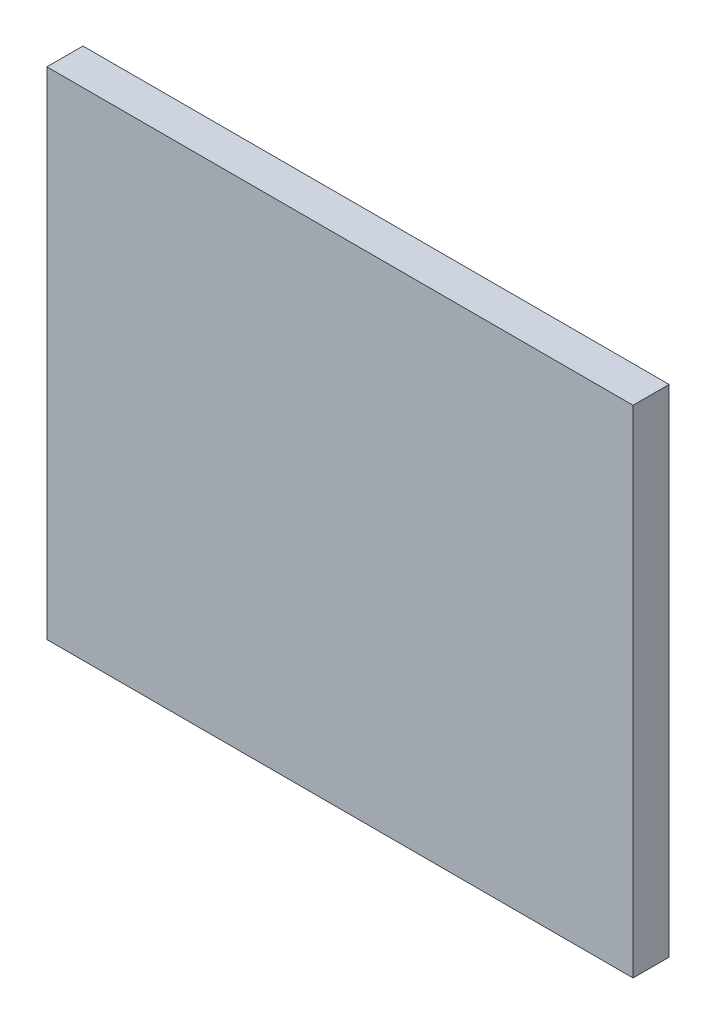
ISO-10303-21;
HEADER;
FILE_DESCRIPTION(('STEP AP214'),'2;1');
FILE_NAME('part.step','',(''),(''),'','','');
FILE_SCHEMA(('AUTOMOTIVE_DESIGN { 1 0 10303 214 1 1 1 1 }'));
ENDSEC;
DATA;
#1=APPLICATION_CONTEXT('core data for automotive mechanical design processes');
#2=APPLICATION_PROTOCOL_DEFINITION('international standard','automotive_design',2000,#1);
#3=PRODUCT_CONTEXT('',#1,'mechanical');
#4=PRODUCT('Part','Part','',(#3));
#5=PRODUCT_RELATED_PRODUCT_CATEGORY('part','',(#4));
#6=PRODUCT_DEFINITION_FORMATION('','',#4);
#7=PRODUCT_DEFINITION_CONTEXT('part definition',#1,'design');
#8=PRODUCT_DEFINITION('design','',#6,#7);
#9=PRODUCT_DEFINITION_SHAPE('','',#8);
#10=(LENGTH_UNIT() NAMED_UNIT(*) SI_UNIT(.MILLI.,.METRE.));
#11=(NAMED_UNIT(*) PLANE_ANGLE_UNIT() SI_UNIT($,.RADIAN.));
#12=(NAMED_UNIT(*) SI_UNIT($,.STERADIAN.) SOLID_ANGLE_UNIT());
#13=UNCERTAINTY_MEASURE_WITH_UNIT(LENGTH_MEASURE(1.E-05),#10,'distance_accuracy_value','');
#14=(GEOMETRIC_REPRESENTATION_CONTEXT(3) GLOBAL_UNCERTAINTY_ASSIGNED_CONTEXT((#13)) GLOBAL_UNIT_ASSIGNED_CONTEXT((#10,
#11,#12)) REPRESENTATION_CONTEXT('',''));
#15=CARTESIAN_POINT('',(0.,0.,0.));
#16=DIRECTION('',(0.,0.,1.));
#17=DIRECTION('',(1.,0.,0.));
#18=AXIS2_PLACEMENT_3D('',#15,#16,#17);
#19=CARTESIAN_POINT('',(0.,0.,0.));
#20=DIRECTION('',(1.,0.,0.));
#21=DIRECTION('',(0.,0.,1.));
#22=AXIS2_PLACEMENT_3D('',#19,#20,#21);
#23=PLANE('',#22);
#24=DIRECTION('',(0.,1.,0.));
#25=VECTOR('',#24,1.);
#26=CARTESIAN_POINT('',(0.,0.,0.04));
#27=LINE('',#26,#25);
#28=CARTESIAN_POINT('',(0.,0.,0.04));
#29=VERTEX_POINT('',#28);
#30=CARTESIAN_POINT('',(0.,0.55,0.04));
#31=VERTEX_POINT('',#30);
#32=EDGE_CURVE('E11',#29,#31,#27,.T.);
#33=ORIENTED_EDGE('',*,*,#32,.T.);
#34=DIRECTION('',(0.,0.,1.));
#35=VECTOR('',#34,1.);
#36=CARTESIAN_POINT('',(0.,0.55,0.));
#37=LINE('',#36,#35);
#38=CARTESIAN_POINT('',(0.,0.55,0.));
#39=VERTEX_POINT('',#38);
#40=EDGE_CURVE('E24',#39,#31,#37,.T.);
#41=ORIENTED_EDGE('',*,*,#40,.F.);
#42=DIRECTION('',(0.,1.,0.));
#43=VECTOR('',#42,1.);
#44=CARTESIAN_POINT('',(0.,0.,0.));
#45=LINE('',#44,#43);
#46=CARTESIAN_POINT('',(0.,0.,0.));
#47=VERTEX_POINT('',#46);
#48=EDGE_CURVE('E86',#47,#39,#45,.T.);
#49=ORIENTED_EDGE('',*,*,#48,.F.);
#50=DIRECTION('',(0.,0.,1.));
#51=VECTOR('',#50,1.);
#52=CARTESIAN_POINT('',(0.,0.,0.));
#53=LINE('',#52,#51);
#54=EDGE_CURVE('E36',#47,#29,#53,.T.);
#55=ORIENTED_EDGE('',*,*,#54,.T.);
#56=EDGE_LOOP('',(#33,#41,#49,#55));
#57=FACE_BOUND('',#56,.T.);
#58=ADVANCED_FACE('F17',(#57),#23,.F.);
#59=CARTESIAN_POINT('',(0.65,0.,0.));
#60=DIRECTION('',(1.,0.,0.));
#61=DIRECTION('',(0.,0.,1.));
#62=AXIS2_PLACEMENT_3D('',#59,#60,#61);
#63=PLANE('',#62);
#64=DIRECTION('',(0.,0.,1.));
#65=VECTOR('',#64,1.);
#66=CARTESIAN_POINT('',(0.65,0.,0.));
#67=LINE('',#66,#65);
#68=CARTESIAN_POINT('',(0.65,0.,0.));
#69=VERTEX_POINT('',#68);
#70=CARTESIAN_POINT('',(0.65,0.,0.04));
#71=VERTEX_POINT('',#70);
#72=EDGE_CURVE('E83',#69,#71,#67,.T.);
#73=ORIENTED_EDGE('',*,*,#72,.F.);
#74=DIRECTION('',(0.,1.,0.));
#75=VECTOR('',#74,1.);
#76=CARTESIAN_POINT('',(0.65,0.,0.));
#77=LINE('',#76,#75);
#78=CARTESIAN_POINT('',(0.65,0.55,0.));
#79=VERTEX_POINT('',#78);
#80=EDGE_CURVE('E63',#69,#79,#77,.T.);
#81=ORIENTED_EDGE('',*,*,#80,.T.);
#82=DIRECTION('',(0.,0.,1.));
#83=VECTOR('',#82,1.);
#84=CARTESIAN_POINT('',(0.65,0.55,0.));
#85=LINE('',#84,#83);
#86=CARTESIAN_POINT('',(0.65,0.55,0.04));
#87=VERTEX_POINT('',#86);
#88=EDGE_CURVE('E57',#79,#87,#85,.T.);
#89=ORIENTED_EDGE('',*,*,#88,.T.);
#90=DIRECTION('',(0.,1.,0.));
#91=VECTOR('',#90,1.);
#92=CARTESIAN_POINT('',(0.65,0.,0.04));
#93=LINE('',#92,#91);
#94=EDGE_CURVE('E60',#71,#87,#93,.T.);
#95=ORIENTED_EDGE('',*,*,#94,.F.);
#96=EDGE_LOOP('',(#73,#81,#89,#95));
#97=FACE_BOUND('',#96,.T.);
#98=ADVANCED_FACE('F59',(#97),#63,.T.);
#99=CARTESIAN_POINT('',(0.,0.,0.));
#100=DIRECTION('',(0.,1.,0.));
#101=DIRECTION('',(0.,0.,1.));
#102=AXIS2_PLACEMENT_3D('',#99,#100,#101);
#103=PLANE('',#102);
#104=ORIENTED_EDGE('',*,*,#72,.T.);
#105=DIRECTION('',(1.,0.,0.));
#106=VECTOR('',#105,1.);
#107=CARTESIAN_POINT('',(0.,0.,0.04));
#108=LINE('',#107,#106);
#109=EDGE_CURVE('E71',#29,#71,#108,.T.);
#110=ORIENTED_EDGE('',*,*,#109,.F.);
#111=ORIENTED_EDGE('',*,*,#54,.F.);
#112=DIRECTION('',(1.,0.,0.));
#113=VECTOR('',#112,1.);
#114=CARTESIAN_POINT('',(0.,0.,0.));
#115=LINE('',#114,#113);
#116=EDGE_CURVE('E76',#47,#69,#115,.T.);
#117=ORIENTED_EDGE('',*,*,#116,.T.);
#118=EDGE_LOOP('',(#104,#110,#111,#117));
#119=FACE_BOUND('',#118,.T.);
#120=ADVANCED_FACE('F91',(#119),#103,.F.);
#121=CARTESIAN_POINT('',(0.,0.55,0.));
#122=DIRECTION('',(0.,1.,0.));
#123=DIRECTION('',(0.,0.,1.));
#124=AXIS2_PLACEMENT_3D('',#121,#122,#123);
#125=PLANE('',#124);
#126=DIRECTION('',(1.,0.,0.));
#127=VECTOR('',#126,1.);
#128=CARTESIAN_POINT('',(0.,0.55,0.));
#129=LINE('',#128,#127);
#130=EDGE_CURVE('E74',#39,#79,#129,.T.);
#131=ORIENTED_EDGE('',*,*,#130,.F.);
#132=ORIENTED_EDGE('',*,*,#40,.T.);
#133=DIRECTION('',(1.,0.,0.));
#134=VECTOR('',#133,1.);
#135=CARTESIAN_POINT('',(0.,0.55,0.04));
#136=LINE('',#135,#134);
#137=EDGE_CURVE('E69',#31,#87,#136,.T.);
#138=ORIENTED_EDGE('',*,*,#137,.T.);
#139=ORIENTED_EDGE('',*,*,#88,.F.);
#140=EDGE_LOOP('',(#131,#132,#138,#139));
#141=FACE_BOUND('',#140,.T.);
#142=ADVANCED_FACE('F73',(#141),#125,.T.);
#143=CARTESIAN_POINT('',(0.,0.,0.));
#144=DIRECTION('',(0.,0.,1.));
#145=DIRECTION('',(1.,0.,0.));
#146=AXIS2_PLACEMENT_3D('',#143,#144,#145);
#147=PLANE('',#146);
#148=ORIENTED_EDGE('',*,*,#130,.T.);
#149=ORIENTED_EDGE('',*,*,#80,.F.);
#150=ORIENTED_EDGE('',*,*,#116,.F.);
#151=ORIENTED_EDGE('',*,*,#48,.T.);
#152=EDGE_LOOP('',(#148,#149,#150,#151));
#153=FACE_BOUND('',#152,.T.);
#154=ADVANCED_FACE('F89',(#153),#147,.F.);
#155=CARTESIAN_POINT('',(0.,0.,0.04));
#156=DIRECTION('',(0.,0.,1.));
#157=DIRECTION('',(1.,0.,0.));
#158=AXIS2_PLACEMENT_3D('',#155,#156,#157);
#159=PLANE('',#158);
#160=ORIENTED_EDGE('',*,*,#32,.F.);
#161=ORIENTED_EDGE('',*,*,#109,.T.);
#162=ORIENTED_EDGE('',*,*,#94,.T.);
#163=ORIENTED_EDGE('',*,*,#137,.F.);
#164=EDGE_LOOP('',(#160,#161,#162,#163));
#165=FACE_BOUND('',#164,.T.);
#166=ADVANCED_FACE('F68',(#165),#159,.T.);
#167=CLOSED_SHELL('',(#58,#98,#120,#142,#154,#166));
#168=MANIFOLD_SOLID_BREP('B1',#167);
#169=ADVANCED_BREP_SHAPE_REPRESENTATION('',(#18,#168),#14);
#170=SHAPE_DEFINITION_REPRESENTATION(#9,#169);
ENDSEC;
END-ISO-10303-21;
